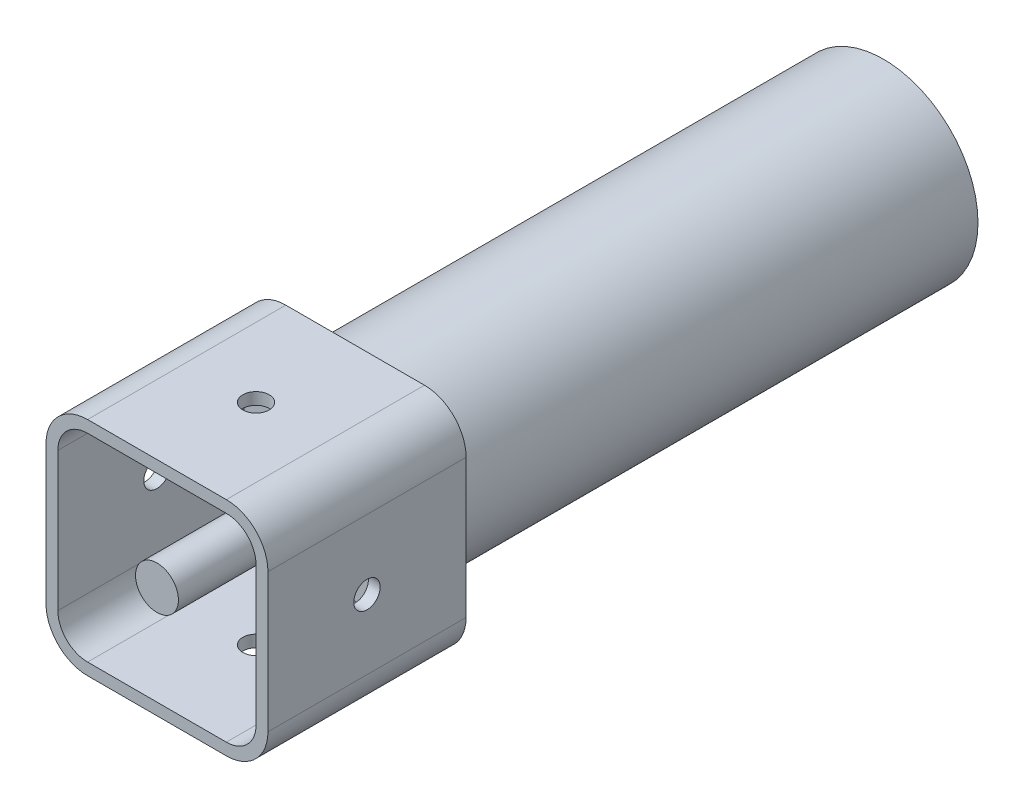
ISO-10303-21;
HEADER;
FILE_DESCRIPTION(('STEP AP214'),'2;1');
FILE_NAME('part.step','',(''),(''),'','','');
FILE_SCHEMA(('AUTOMOTIVE_DESIGN { 1 0 10303 214 1 1 1 1 }'));
ENDSEC;
DATA;
#1=APPLICATION_CONTEXT('core data for automotive mechanical design processes');
#2=APPLICATION_PROTOCOL_DEFINITION('international standard','automotive_design',2000,#1);
#3=PRODUCT_CONTEXT('',#1,'mechanical');
#4=PRODUCT('Part','Part','',(#3));
#5=PRODUCT_RELATED_PRODUCT_CATEGORY('part','',(#4));
#6=PRODUCT_DEFINITION_FORMATION('','',#4);
#7=PRODUCT_DEFINITION_CONTEXT('part definition',#1,'design');
#8=PRODUCT_DEFINITION('design','',#6,#7);
#9=PRODUCT_DEFINITION_SHAPE('','',#8);
#10=(LENGTH_UNIT() NAMED_UNIT(*) SI_UNIT(.MILLI.,.METRE.));
#11=(NAMED_UNIT(*) PLANE_ANGLE_UNIT() SI_UNIT($,.RADIAN.));
#12=(NAMED_UNIT(*) SI_UNIT($,.STERADIAN.) SOLID_ANGLE_UNIT());
#13=UNCERTAINTY_MEASURE_WITH_UNIT(LENGTH_MEASURE(1.E-05),#10,'distance_accuracy_value','');
#14=(GEOMETRIC_REPRESENTATION_CONTEXT(3) GLOBAL_UNCERTAINTY_ASSIGNED_CONTEXT((#13)) GLOBAL_UNIT_ASSIGNED_CONTEXT((#10,
#11,#12)) REPRESENTATION_CONTEXT('',''));
#15=CARTESIAN_POINT('',(0.,0.,0.));
#16=DIRECTION('',(0.,0.,1.));
#17=DIRECTION('',(1.,0.,0.));
#18=AXIS2_PLACEMENT_3D('',#15,#16,#17);
#19=CARTESIAN_POINT('',(0.,0.,0.));
#20=DIRECTION('',(0.,0.,1.));
#21=DIRECTION('',(1.,0.,0.));
#22=AXIS2_PLACEMENT_3D('',#19,#20,#21);
#23=PLANE('',#22);
#24=CARTESIAN_POINT('',(0.,0.,0.));
#25=DIRECTION('',(0.,0.,1.));
#26=DIRECTION('',(1.,0.,0.));
#27=AXIS2_PLACEMENT_3D('',#24,#25,#26);
#28=CIRCLE('',#27,16.3);
#29=CARTESIAN_POINT('',(16.3,0.,0.));
#30=VERTEX_POINT('',#29);
#31=EDGE_CURVE('E11',#30,#30,#28,.T.);
#32=ORIENTED_EDGE('',*,*,#31,.T.);
#33=EDGE_LOOP('',(#32));
#34=FACE_BOUND('',#33,.T.);
#35=DIRECTION('',(-1.,0.,0.));
#36=VECTOR('',#35,1.);
#37=CARTESIAN_POINT('',(0.,16.8,0.));
#38=LINE('',#37,#36);
#39=CARTESIAN_POINT('',(10.5,16.8,0.));
#40=VERTEX_POINT('',#39);
#41=CARTESIAN_POINT('',(-10.5,16.8,0.));
#42=VERTEX_POINT('',#41);
#43=EDGE_CURVE('E237',#40,#42,#38,.T.);
#44=ORIENTED_EDGE('',*,*,#43,.F.);
#45=CARTESIAN_POINT('',(10.5,10.5,0.));
#46=DIRECTION('',(0.,0.,1.));
#47=DIRECTION('',(1.,0.,0.));
#48=AXIS2_PLACEMENT_3D('',#45,#46,#47);
#49=CIRCLE('',#48,6.3);
#50=CARTESIAN_POINT('',(16.8,10.5,0.));
#51=VERTEX_POINT('',#50);
#52=EDGE_CURVE('E293',#40,#51,#49,.F.);
#53=ORIENTED_EDGE('',*,*,#52,.T.);
#54=DIRECTION('',(0.,-1.,0.));
#55=VECTOR('',#54,1.);
#56=CARTESIAN_POINT('',(16.8,0.,0.));
#57=LINE('',#56,#55);
#58=CARTESIAN_POINT('',(16.8,-10.5,0.));
#59=VERTEX_POINT('',#58);
#60=EDGE_CURVE('E326',#51,#59,#57,.T.);
#61=ORIENTED_EDGE('',*,*,#60,.T.);
#62=CARTESIAN_POINT('',(10.5,-10.5,0.));
#63=DIRECTION('',(0.,0.,1.));
#64=DIRECTION('',(1.,0.,0.));
#65=AXIS2_PLACEMENT_3D('',#62,#63,#64);
#66=CIRCLE('',#65,6.3);
#67=CARTESIAN_POINT('',(10.5,-16.8,0.));
#68=VERTEX_POINT('',#67);
#69=EDGE_CURVE('E323',#68,#59,#66,.T.);
#70=ORIENTED_EDGE('',*,*,#69,.F.);
#71=DIRECTION('',(-1.,0.,0.));
#72=VECTOR('',#71,1.);
#73=CARTESIAN_POINT('',(0.,-16.8,0.));
#74=LINE('',#73,#72);
#75=CARTESIAN_POINT('',(-10.5,-16.8,0.));
#76=VERTEX_POINT('',#75);
#77=EDGE_CURVE('E320',#68,#76,#74,.T.);
#78=ORIENTED_EDGE('',*,*,#77,.T.);
#79=CARTESIAN_POINT('',(-10.5,-10.5,0.));
#80=DIRECTION('',(0.,0.,1.));
#81=DIRECTION('',(1.,0.,0.));
#82=AXIS2_PLACEMENT_3D('',#79,#80,#81);
#83=CIRCLE('',#82,6.3);
#84=CARTESIAN_POINT('',(-16.8,-10.5,0.));
#85=VERTEX_POINT('',#84);
#86=EDGE_CURVE('E317',#85,#76,#83,.T.);
#87=ORIENTED_EDGE('',*,*,#86,.F.);
#88=DIRECTION('',(0.,-1.,0.));
#89=VECTOR('',#88,1.);
#90=CARTESIAN_POINT('',(-16.8,0.,0.));
#91=LINE('',#90,#89);
#92=CARTESIAN_POINT('',(-16.8,10.5,0.));
#93=VERTEX_POINT('',#92);
#94=EDGE_CURVE('E315',#93,#85,#91,.T.);
#95=ORIENTED_EDGE('',*,*,#94,.F.);
#96=CARTESIAN_POINT('',(-10.5,10.5,0.));
#97=DIRECTION('',(0.,0.,1.));
#98=DIRECTION('',(1.,0.,0.));
#99=AXIS2_PLACEMENT_3D('',#96,#97,#98);
#100=CIRCLE('',#99,6.3);
#101=EDGE_CURVE('E313',#42,#93,#100,.T.);
#102=ORIENTED_EDGE('',*,*,#101,.F.);
#103=EDGE_LOOP('',(#44,#53,#61,#70,#78,#87,#95,#102));
#104=FACE_BOUND('',#103,.T.);
#105=ADVANCED_FACE('F32',(#34,#104),#23,.F.);
#106=CARTESIAN_POINT('',(0.,0.,1.8));
#107=DIRECTION('',(0.,0.,1.));
#108=DIRECTION('',(1.,0.,0.));
#109=AXIS2_PLACEMENT_3D('',#106,#107,#108);
#110=PLANE('',#109);
#111=DIRECTION('',(-1.,0.,0.));
#112=VECTOR('',#111,1.);
#113=CARTESIAN_POINT('',(0.,15.,1.8));
#114=LINE('',#113,#112);
#115=CARTESIAN_POINT('',(10.5,15.,1.8));
#116=VERTEX_POINT('',#115);
#117=CARTESIAN_POINT('',(-10.5,15.,1.8));
#118=VERTEX_POINT('',#117);
#119=EDGE_CURVE('E230',#116,#118,#114,.T.);
#120=ORIENTED_EDGE('',*,*,#119,.T.);
#121=CARTESIAN_POINT('',(-10.5,10.5,1.8));
#122=DIRECTION('',(0.,0.,1.));
#123=DIRECTION('',(1.,0.,0.));
#124=AXIS2_PLACEMENT_3D('',#121,#122,#123);
#125=CIRCLE('',#124,4.5);
#126=CARTESIAN_POINT('',(-15.,10.5,1.8));
#127=VERTEX_POINT('',#126);
#128=EDGE_CURVE('E233',#118,#127,#125,.T.);
#129=ORIENTED_EDGE('',*,*,#128,.T.);
#130=DIRECTION('',(0.,-1.,0.));
#131=VECTOR('',#130,1.);
#132=CARTESIAN_POINT('',(-15.,0.,1.8));
#133=LINE('',#132,#131);
#134=CARTESIAN_POINT('',(-15.,-10.5,1.8));
#135=VERTEX_POINT('',#134);
#136=EDGE_CURVE('E244',#127,#135,#133,.T.);
#137=ORIENTED_EDGE('',*,*,#136,.T.);
#138=CARTESIAN_POINT('',(-10.5,-10.5,1.8));
#139=DIRECTION('',(0.,0.,1.));
#140=DIRECTION('',(1.,0.,0.));
#141=AXIS2_PLACEMENT_3D('',#138,#139,#140);
#142=CIRCLE('',#141,4.5);
#143=CARTESIAN_POINT('',(-10.5,-15.,1.8));
#144=VERTEX_POINT('',#143);
#145=EDGE_CURVE('E249',#135,#144,#142,.T.);
#146=ORIENTED_EDGE('',*,*,#145,.T.);
#147=DIRECTION('',(-1.,0.,0.));
#148=VECTOR('',#147,1.);
#149=CARTESIAN_POINT('',(0.,-15.,1.8));
#150=LINE('',#149,#148);
#151=CARTESIAN_POINT('',(10.5,-15.,1.8));
#152=VERTEX_POINT('',#151);
#153=EDGE_CURVE('E255',#152,#144,#150,.T.);
#154=ORIENTED_EDGE('',*,*,#153,.F.);
#155=CARTESIAN_POINT('',(10.5,-10.5,1.8));
#156=DIRECTION('',(0.,0.,1.));
#157=DIRECTION('',(1.,0.,0.));
#158=AXIS2_PLACEMENT_3D('',#155,#156,#157);
#159=CIRCLE('',#158,4.5);
#160=CARTESIAN_POINT('',(15.,-10.5,1.8));
#161=VERTEX_POINT('',#160);
#162=EDGE_CURVE('E260',#152,#161,#159,.T.);
#163=ORIENTED_EDGE('',*,*,#162,.T.);
#164=DIRECTION('',(0.,-1.,0.));
#165=VECTOR('',#164,1.);
#166=CARTESIAN_POINT('',(15.,0.,1.8));
#167=LINE('',#166,#165);
#168=CARTESIAN_POINT('',(15.,10.5,1.8));
#169=VERTEX_POINT('',#168);
#170=EDGE_CURVE('E265',#169,#161,#167,.T.);
#171=ORIENTED_EDGE('',*,*,#170,.F.);
#172=CARTESIAN_POINT('',(10.5,10.5,1.8));
#173=DIRECTION('',(0.,0.,1.));
#174=DIRECTION('',(1.,0.,0.));
#175=AXIS2_PLACEMENT_3D('',#172,#173,#174);
#176=CIRCLE('',#175,4.5);
#177=EDGE_CURVE('E269',#116,#169,#176,.F.);
#178=ORIENTED_EDGE('',*,*,#177,.F.);
#179=EDGE_LOOP('',(#120,#129,#137,#146,#154,#163,#171,#178));
#180=FACE_BOUND('',#179,.T.);
#181=CARTESIAN_POINT('',(0.,0.,1.8));
#182=DIRECTION('',(0.,0.,1.));
#183=DIRECTION('',(1.,0.,0.));
#184=AXIS2_PLACEMENT_3D('',#181,#182,#183);
#185=CIRCLE('',#184,3.25);
#186=CARTESIAN_POINT('',(3.25,0.,1.8));
#187=VERTEX_POINT('',#186);
#188=EDGE_CURVE('E229',#187,#187,#185,.F.);
#189=ORIENTED_EDGE('',*,*,#188,.T.);
#190=EDGE_LOOP('',(#189));
#191=FACE_BOUND('',#190,.T.);
#192=ADVANCED_FACE('F365',(#180,#191),#110,.T.);
#193=CARTESIAN_POINT('',(0.,16.8,30.));
#194=DIRECTION('',(0.,-1.,0.));
#195=DIRECTION('',(0.,0.,-1.));
#196=AXIS2_PLACEMENT_3D('',#193,#194,#195);
#197=PLANE('',#196);
#198=CARTESIAN_POINT('',(0.,16.8,15.));
#199=DIRECTION('',(0.,1.,0.));
#200=DIRECTION('',(0.,0.,1.));
#201=AXIS2_PLACEMENT_3D('',#198,#199,#200);
#202=CIRCLE('',#201,2.);
#203=CARTESIAN_POINT('',(0.,16.8,17.));
#204=VERTEX_POINT('',#203);
#205=EDGE_CURVE('E223',#204,#204,#202,.T.);
#206=ORIENTED_EDGE('',*,*,#205,.F.);
#207=EDGE_LOOP('',(#206));
#208=FACE_BOUND('',#207,.T.);
#209=ORIENTED_EDGE('',*,*,#43,.T.);
#210=DIRECTION('',(0.,0.,-1.));
#211=VECTOR('',#210,1.);
#212=CARTESIAN_POINT('',(-10.5,16.8,30.));
#213=LINE('',#212,#211);
#214=CARTESIAN_POINT('',(-10.5,16.8,30.));
#215=VERTEX_POINT('',#214);
#216=EDGE_CURVE('E346',#215,#42,#213,.T.);
#217=ORIENTED_EDGE('',*,*,#216,.F.);
#218=DIRECTION('',(-1.,0.,0.));
#219=VECTOR('',#218,1.);
#220=CARTESIAN_POINT('',(0.,16.8,30.));
#221=LINE('',#220,#219);
#222=CARTESIAN_POINT('',(10.5,16.8,30.));
#223=VERTEX_POINT('',#222);
#224=EDGE_CURVE('E289',#223,#215,#221,.T.);
#225=ORIENTED_EDGE('',*,*,#224,.F.);
#226=DIRECTION('',(0.,0.,-1.));
#227=VECTOR('',#226,1.);
#228=CARTESIAN_POINT('',(10.5,16.8,30.));
#229=LINE('',#228,#227);
#230=EDGE_CURVE('E310',#223,#40,#229,.T.);
#231=ORIENTED_EDGE('',*,*,#230,.T.);
#232=EDGE_LOOP('',(#209,#217,#225,#231));
#233=FACE_BOUND('',#232,.T.);
#234=ADVANCED_FACE('F372',(#208,#233),#197,.F.);
#235=CARTESIAN_POINT('',(-10.5,10.5,30.));
#236=DIRECTION('',(0.,0.,-1.));
#237=DIRECTION('',(-1.,0.,0.));
#238=AXIS2_PLACEMENT_3D('',#235,#236,#237);
#239=CYLINDRICAL_SURFACE('',#238,6.3);
#240=ORIENTED_EDGE('',*,*,#101,.T.);
#241=DIRECTION('',(0.,0.,-1.));
#242=VECTOR('',#241,1.);
#243=CARTESIAN_POINT('',(-16.8,10.5,30.));
#244=LINE('',#243,#242);
#245=CARTESIAN_POINT('',(-16.8,10.5,30.));
#246=VERTEX_POINT('',#245);
#247=EDGE_CURVE('E343',#246,#93,#244,.T.);
#248=ORIENTED_EDGE('',*,*,#247,.F.);
#249=CARTESIAN_POINT('',(-10.5,10.5,30.));
#250=DIRECTION('',(0.,0.,1.));
#251=DIRECTION('',(1.,0.,0.));
#252=AXIS2_PLACEMENT_3D('',#249,#250,#251);
#253=CIRCLE('',#252,6.3);
#254=EDGE_CURVE('E292',#215,#246,#253,.T.);
#255=ORIENTED_EDGE('',*,*,#254,.F.);
#256=ORIENTED_EDGE('',*,*,#216,.T.);
#257=EDGE_LOOP('',(#240,#248,#255,#256));
#258=FACE_BOUND('',#257,.T.);
#259=ADVANCED_FACE('F471',(#258),#239,.T.);
#260=CARTESIAN_POINT('',(-16.8,0.,30.));
#261=DIRECTION('',(1.,0.,0.));
#262=DIRECTION('',(0.,1.,0.));
#263=AXIS2_PLACEMENT_3D('',#260,#261,#262);
#264=PLANE('',#263);
#265=CARTESIAN_POINT('',(-16.8,1.77813803170919E-13,15.));
#266=DIRECTION('',(-1.,0.,0.));
#267=DIRECTION('',(0.,0.,1.));
#268=AXIS2_PLACEMENT_3D('',#265,#266,#267);
#269=CIRCLE('',#268,2.);
#270=CARTESIAN_POINT('',(-16.8,1.77813803170919E-13,17.));
#271=VERTEX_POINT('',#270);
#272=EDGE_CURVE('E205',#271,#271,#269,.T.);
#273=ORIENTED_EDGE('',*,*,#272,.F.);
#274=EDGE_LOOP('',(#273));
#275=FACE_BOUND('',#274,.T.);
#276=ORIENTED_EDGE('',*,*,#94,.T.);
#277=DIRECTION('',(0.,0.,-1.));
#278=VECTOR('',#277,1.);
#279=CARTESIAN_POINT('',(-16.8,-10.5,30.));
#280=LINE('',#279,#278);
#281=CARTESIAN_POINT('',(-16.8,-10.5,30.));
#282=VERTEX_POINT('',#281);
#283=EDGE_CURVE('E340',#282,#85,#280,.T.);
#284=ORIENTED_EDGE('',*,*,#283,.F.);
#285=DIRECTION('',(0.,-1.,0.));
#286=VECTOR('',#285,1.);
#287=CARTESIAN_POINT('',(-16.8,0.,30.));
#288=LINE('',#287,#286);
#289=EDGE_CURVE('E295',#246,#282,#288,.T.);
#290=ORIENTED_EDGE('',*,*,#289,.F.);
#291=ORIENTED_EDGE('',*,*,#247,.T.);
#292=EDGE_LOOP('',(#276,#284,#290,#291));
#293=FACE_BOUND('',#292,.T.);
#294=ADVANCED_FACE('F476',(#275,#293),#264,.F.);
#295=CARTESIAN_POINT('',(-10.5,-10.5,30.));
#296=DIRECTION('',(0.,0.,-1.));
#297=DIRECTION('',(-1.,0.,0.));
#298=AXIS2_PLACEMENT_3D('',#295,#296,#297);
#299=CYLINDRICAL_SURFACE('',#298,6.3);
#300=ORIENTED_EDGE('',*,*,#86,.T.);
#301=DIRECTION('',(0.,0.,-1.));
#302=VECTOR('',#301,1.);
#303=CARTESIAN_POINT('',(-10.5,-16.8,30.));
#304=LINE('',#303,#302);
#305=CARTESIAN_POINT('',(-10.5,-16.8,30.));
#306=VERTEX_POINT('',#305);
#307=EDGE_CURVE('E338',#306,#76,#304,.T.);
#308=ORIENTED_EDGE('',*,*,#307,.F.);
#309=CARTESIAN_POINT('',(-10.5,-10.5,30.));
#310=DIRECTION('',(0.,0.,1.));
#311=DIRECTION('',(1.,0.,0.));
#312=AXIS2_PLACEMENT_3D('',#309,#310,#311);
#313=CIRCLE('',#312,6.3);
#314=EDGE_CURVE('E297',#282,#306,#313,.T.);
#315=ORIENTED_EDGE('',*,*,#314,.F.);
#316=ORIENTED_EDGE('',*,*,#283,.T.);
#317=EDGE_LOOP('',(#300,#308,#315,#316));
#318=FACE_BOUND('',#317,.T.);
#319=ADVANCED_FACE('F481',(#318),#299,.T.);
#320=CARTESIAN_POINT('',(0.,-16.8,30.));
#321=DIRECTION('',(0.,-1.,0.));
#322=DIRECTION('',(0.,0.,-1.));
#323=AXIS2_PLACEMENT_3D('',#320,#321,#322);
#324=PLANE('',#323);
#325=CARTESIAN_POINT('',(0.,-16.8,15.));
#326=DIRECTION('',(0.,-1.,0.));
#327=DIRECTION('',(0.,0.,1.));
#328=AXIS2_PLACEMENT_3D('',#325,#326,#327);
#329=CIRCLE('',#328,2.);
#330=CARTESIAN_POINT('',(0.,-16.8,17.));
#331=VERTEX_POINT('',#330);
#332=EDGE_CURVE('E211',#331,#331,#329,.T.);
#333=ORIENTED_EDGE('',*,*,#332,.F.);
#334=EDGE_LOOP('',(#333));
#335=FACE_BOUND('',#334,.T.);
#336=ORIENTED_EDGE('',*,*,#77,.F.);
#337=DIRECTION('',(0.,0.,-1.));
#338=VECTOR('',#337,1.);
#339=CARTESIAN_POINT('',(10.5,-16.8,30.));
#340=LINE('',#339,#338);
#341=CARTESIAN_POINT('',(10.5,-16.8,30.));
#342=VERTEX_POINT('',#341);
#343=EDGE_CURVE('E336',#342,#68,#340,.T.);
#344=ORIENTED_EDGE('',*,*,#343,.F.);
#345=DIRECTION('',(-1.,0.,0.));
#346=VECTOR('',#345,1.);
#347=CARTESIAN_POINT('',(0.,-16.8,30.));
#348=LINE('',#347,#346);
#349=EDGE_CURVE('E299',#342,#306,#348,.T.);
#350=ORIENTED_EDGE('',*,*,#349,.T.);
#351=ORIENTED_EDGE('',*,*,#307,.T.);
#352=EDGE_LOOP('',(#336,#344,#350,#351));
#353=FACE_BOUND('',#352,.T.);
#354=ADVANCED_FACE('F485',(#335,#353),#324,.T.);
#355=CARTESIAN_POINT('',(10.5,-10.5,30.));
#356=DIRECTION('',(0.,0.,-1.));
#357=DIRECTION('',(-1.,0.,0.));
#358=AXIS2_PLACEMENT_3D('',#355,#356,#357);
#359=CYLINDRICAL_SURFACE('',#358,6.3);
#360=ORIENTED_EDGE('',*,*,#69,.T.);
#361=DIRECTION('',(0.,0.,-1.));
#362=VECTOR('',#361,1.);
#363=CARTESIAN_POINT('',(16.8,-10.5,30.));
#364=LINE('',#363,#362);
#365=CARTESIAN_POINT('',(16.8,-10.5,30.));
#366=VERTEX_POINT('',#365);
#367=EDGE_CURVE('E334',#366,#59,#364,.T.);
#368=ORIENTED_EDGE('',*,*,#367,.F.);
#369=CARTESIAN_POINT('',(10.5,-10.5,30.));
#370=DIRECTION('',(0.,0.,1.));
#371=DIRECTION('',(1.,0.,0.));
#372=AXIS2_PLACEMENT_3D('',#369,#370,#371);
#373=CIRCLE('',#372,6.3);
#374=EDGE_CURVE('E302',#342,#366,#373,.T.);
#375=ORIENTED_EDGE('',*,*,#374,.F.);
#376=ORIENTED_EDGE('',*,*,#343,.T.);
#377=EDGE_LOOP('',(#360,#368,#375,#376));
#378=FACE_BOUND('',#377,.T.);
#379=ADVANCED_FACE('F490',(#378),#359,.T.);
#380=CARTESIAN_POINT('',(16.8,0.,30.));
#381=DIRECTION('',(1.,0.,0.));
#382=DIRECTION('',(0.,0.,-1.));
#383=AXIS2_PLACEMENT_3D('',#380,#381,#382);
#384=PLANE('',#383);
#385=CARTESIAN_POINT('',(16.8,0.,15.));
#386=DIRECTION('',(1.,0.,0.));
#387=DIRECTION('',(0.,0.,1.));
#388=AXIS2_PLACEMENT_3D('',#385,#386,#387);
#389=CIRCLE('',#388,2.);
#390=CARTESIAN_POINT('',(16.8,0.,17.));
#391=VERTEX_POINT('',#390);
#392=EDGE_CURVE('E214',#391,#391,#389,.T.);
#393=ORIENTED_EDGE('',*,*,#392,.F.);
#394=EDGE_LOOP('',(#393));
#395=FACE_BOUND('',#394,.T.);
#396=ORIENTED_EDGE('',*,*,#60,.F.);
#397=DIRECTION('',(0.,0.,-1.));
#398=VECTOR('',#397,1.);
#399=CARTESIAN_POINT('',(16.8,10.5,30.));
#400=LINE('',#399,#398);
#401=CARTESIAN_POINT('',(16.8,10.5,30.));
#402=VERTEX_POINT('',#401);
#403=EDGE_CURVE('E332',#402,#51,#400,.T.);
#404=ORIENTED_EDGE('',*,*,#403,.F.);
#405=DIRECTION('',(0.,-1.,0.));
#406=VECTOR('',#405,1.);
#407=CARTESIAN_POINT('',(16.8,0.,30.));
#408=LINE('',#407,#406);
#409=EDGE_CURVE('E304',#402,#366,#408,.T.);
#410=ORIENTED_EDGE('',*,*,#409,.T.);
#411=ORIENTED_EDGE('',*,*,#367,.T.);
#412=EDGE_LOOP('',(#396,#404,#410,#411));
#413=FACE_BOUND('',#412,.T.);
#414=ADVANCED_FACE('F458',(#395,#413),#384,.T.);
#415=CARTESIAN_POINT('',(10.5,10.5,30.));
#416=DIRECTION('',(0.,0.,-1.));
#417=DIRECTION('',(-1.,0.,0.));
#418=AXIS2_PLACEMENT_3D('',#415,#416,#417);
#419=CYLINDRICAL_SURFACE('',#418,6.3);
#420=ORIENTED_EDGE('',*,*,#52,.F.);
#421=ORIENTED_EDGE('',*,*,#230,.F.);
#422=CARTESIAN_POINT('',(10.5,10.5,30.));
#423=DIRECTION('',(0.,0.,1.));
#424=DIRECTION('',(1.,0.,0.));
#425=AXIS2_PLACEMENT_3D('',#422,#423,#424);
#426=CIRCLE('',#425,6.3);
#427=EDGE_CURVE('E307',#223,#402,#426,.F.);
#428=ORIENTED_EDGE('',*,*,#427,.T.);
#429=ORIENTED_EDGE('',*,*,#403,.T.);
#430=EDGE_LOOP('',(#420,#421,#428,#429));
#431=FACE_BOUND('',#430,.T.);
#432=ADVANCED_FACE('F453',(#431),#419,.T.);
#433=CARTESIAN_POINT('',(0.,0.,30.));
#434=DIRECTION('',(0.,0.,1.));
#435=DIRECTION('',(1.,0.,0.));
#436=AXIS2_PLACEMENT_3D('',#433,#434,#435);
#437=PLANE('',#436);
#438=DIRECTION('',(-1.,0.,0.));
#439=VECTOR('',#438,1.);
#440=CARTESIAN_POINT('',(0.,15.,30.));
#441=LINE('',#440,#439);
#442=CARTESIAN_POINT('',(10.5,15.,30.));
#443=VERTEX_POINT('',#442);
#444=CARTESIAN_POINT('',(-10.5,15.,30.));
#445=VERTEX_POINT('',#444);
#446=EDGE_CURVE('E273',#443,#445,#441,.T.);
#447=ORIENTED_EDGE('',*,*,#446,.F.);
#448=CARTESIAN_POINT('',(10.5,10.5,30.));
#449=DIRECTION('',(0.,0.,1.));
#450=DIRECTION('',(1.,0.,0.));
#451=AXIS2_PLACEMENT_3D('',#448,#449,#450);
#452=CIRCLE('',#451,4.5);
#453=CARTESIAN_POINT('',(15.,10.5,30.));
#454=VERTEX_POINT('',#453);
#455=EDGE_CURVE('E242',#443,#454,#452,.F.);
#456=ORIENTED_EDGE('',*,*,#455,.T.);
#457=DIRECTION('',(0.,-1.,0.));
#458=VECTOR('',#457,1.);
#459=CARTESIAN_POINT('',(15.,0.,30.));
#460=LINE('',#459,#458);
#461=CARTESIAN_POINT('',(15.,-10.5,30.));
#462=VERTEX_POINT('',#461);
#463=EDGE_CURVE('E55',#454,#462,#460,.T.);
#464=ORIENTED_EDGE('',*,*,#463,.T.);
#465=CARTESIAN_POINT('',(10.5,-10.5,30.));
#466=DIRECTION('',(0.,0.,1.));
#467=DIRECTION('',(1.,0.,0.));
#468=AXIS2_PLACEMENT_3D('',#465,#466,#467);
#469=CIRCLE('',#468,4.5);
#470=CARTESIAN_POINT('',(10.5,-15.,30.));
#471=VERTEX_POINT('',#470);
#472=EDGE_CURVE('E284',#471,#462,#469,.T.);
#473=ORIENTED_EDGE('',*,*,#472,.F.);
#474=DIRECTION('',(-1.,0.,0.));
#475=VECTOR('',#474,1.);
#476=CARTESIAN_POINT('',(0.,-15.,30.));
#477=LINE('',#476,#475);
#478=CARTESIAN_POINT('',(-10.5,-15.,30.));
#479=VERTEX_POINT('',#478);
#480=EDGE_CURVE('E281',#471,#479,#477,.T.);
#481=ORIENTED_EDGE('',*,*,#480,.T.);
#482=CARTESIAN_POINT('',(-10.5,-10.5,30.));
#483=DIRECTION('',(0.,0.,1.));
#484=DIRECTION('',(1.,0.,0.));
#485=AXIS2_PLACEMENT_3D('',#482,#483,#484);
#486=CIRCLE('',#485,4.5);
#487=CARTESIAN_POINT('',(-15.,-10.5,30.));
#488=VERTEX_POINT('',#487);
#489=EDGE_CURVE('E279',#488,#479,#486,.T.);
#490=ORIENTED_EDGE('',*,*,#489,.F.);
#491=DIRECTION('',(0.,-1.,0.));
#492=VECTOR('',#491,1.);
#493=CARTESIAN_POINT('',(-15.,0.,30.));
#494=LINE('',#493,#492);
#495=CARTESIAN_POINT('',(-15.,10.5,30.));
#496=VERTEX_POINT('',#495);
#497=EDGE_CURVE('E277',#496,#488,#494,.T.);
#498=ORIENTED_EDGE('',*,*,#497,.F.);
#499=CARTESIAN_POINT('',(-10.5,10.5,30.));
#500=DIRECTION('',(0.,0.,1.));
#501=DIRECTION('',(1.,0.,0.));
#502=AXIS2_PLACEMENT_3D('',#499,#500,#501);
#503=CIRCLE('',#502,4.5);
#504=EDGE_CURVE('E275',#445,#496,#503,.T.);
#505=ORIENTED_EDGE('',*,*,#504,.F.);
#506=EDGE_LOOP('',(#447,#456,#464,#473,#481,#490,#498,#505));
#507=FACE_BOUND('',#506,.T.);
#508=ORIENTED_EDGE('',*,*,#224,.T.);
#509=ORIENTED_EDGE('',*,*,#254,.T.);
#510=ORIENTED_EDGE('',*,*,#289,.T.);
#511=ORIENTED_EDGE('',*,*,#314,.T.);
#512=ORIENTED_EDGE('',*,*,#349,.F.);
#513=ORIENTED_EDGE('',*,*,#374,.T.);
#514=ORIENTED_EDGE('',*,*,#409,.F.);
#515=ORIENTED_EDGE('',*,*,#427,.F.);
#516=EDGE_LOOP('',(#508,#509,#510,#511,#512,#513,#514,#515));
#517=FACE_BOUND('',#516,.T.);
#518=ADVANCED_FACE('F425',(#507,#517),#437,.T.);
#519=CARTESIAN_POINT('',(0.,15.,30.));
#520=DIRECTION('',(0.,-1.,0.));
#521=DIRECTION('',(0.,0.,-1.));
#522=AXIS2_PLACEMENT_3D('',#519,#520,#521);
#523=PLANE('',#522);
#524=CARTESIAN_POINT('',(0.,15.,15.));
#525=DIRECTION('',(0.,-1.,0.));
#526=DIRECTION('',(0.,0.,-1.));
#527=AXIS2_PLACEMENT_3D('',#524,#525,#526);
#528=CIRCLE('',#527,2.);
#529=CARTESIAN_POINT('',(0.,15.,13.));
#530=VERTEX_POINT('',#529);
#531=EDGE_CURVE('E220',#530,#530,#528,.F.);
#532=ORIENTED_EDGE('',*,*,#531,.T.);
#533=EDGE_LOOP('',(#532));
#534=FACE_BOUND('',#533,.T.);
#535=ORIENTED_EDGE('',*,*,#119,.F.);
#536=DIRECTION('',(0.,0.,-1.));
#537=VECTOR('',#536,1.);
#538=CARTESIAN_POINT('',(10.5,15.,30.));
#539=LINE('',#538,#537);
#540=EDGE_CURVE('E239',#443,#116,#539,.T.);
#541=ORIENTED_EDGE('',*,*,#540,.F.);
#542=ORIENTED_EDGE('',*,*,#446,.T.);
#543=DIRECTION('',(0.,0.,-1.));
#544=VECTOR('',#543,1.);
#545=CARTESIAN_POINT('',(-10.5,15.,30.));
#546=LINE('',#545,#544);
#547=EDGE_CURVE('E234',#445,#118,#546,.T.);
#548=ORIENTED_EDGE('',*,*,#547,.T.);
#549=EDGE_LOOP('',(#535,#541,#542,#548));
#550=FACE_BOUND('',#549,.T.);
#551=ADVANCED_FACE('F421',(#534,#550),#523,.T.);
#552=CARTESIAN_POINT('',(-10.5,10.5,30.));
#553=DIRECTION('',(0.,0.,-1.));
#554=DIRECTION('',(-1.,0.,0.));
#555=AXIS2_PLACEMENT_3D('',#552,#553,#554);
#556=CYLINDRICAL_SURFACE('',#555,4.5);
#557=ORIENTED_EDGE('',*,*,#128,.F.);
#558=ORIENTED_EDGE('',*,*,#547,.F.);
#559=ORIENTED_EDGE('',*,*,#504,.T.);
#560=DIRECTION('',(0.,0.,1.));
#561=VECTOR('',#560,1.);
#562=CARTESIAN_POINT('',(-15.,10.5,30.));
#563=LINE('',#562,#561);
#564=EDGE_CURVE('E238',#496,#127,#563,.F.);
#565=ORIENTED_EDGE('',*,*,#564,.T.);
#566=EDGE_LOOP('',(#557,#558,#559,#565));
#567=FACE_BOUND('',#566,.T.);
#568=ADVANCED_FACE('F424',(#567),#556,.F.);
#569=CARTESIAN_POINT('',(-15.,0.,30.));
#570=DIRECTION('',(1.,0.,0.));
#571=DIRECTION('',(0.,1.,0.));
#572=AXIS2_PLACEMENT_3D('',#569,#570,#571);
#573=PLANE('',#572);
#574=CARTESIAN_POINT('',(-15.,1.58959803941166E-13,15.));
#575=DIRECTION('',(1.,0.,0.));
#576=DIRECTION('',(0.,1.,0.));
#577=AXIS2_PLACEMENT_3D('',#574,#575,#576);
#578=CIRCLE('',#577,2.);
#579=CARTESIAN_POINT('',(-15.,2.00000000000016,15.));
#580=VERTEX_POINT('',#579);
#581=EDGE_CURVE('E197',#580,#580,#578,.F.);
#582=ORIENTED_EDGE('',*,*,#581,.T.);
#583=EDGE_LOOP('',(#582));
#584=FACE_BOUND('',#583,.T.);
#585=ORIENTED_EDGE('',*,*,#136,.F.);
#586=ORIENTED_EDGE('',*,*,#564,.F.);
#587=ORIENTED_EDGE('',*,*,#497,.T.);
#588=DIRECTION('',(0.,0.,-1.));
#589=VECTOR('',#588,1.);
#590=CARTESIAN_POINT('',(-15.,-10.5,30.));
#591=LINE('',#590,#589);
#592=EDGE_CURVE('E247',#488,#135,#591,.T.);
#593=ORIENTED_EDGE('',*,*,#592,.T.);
#594=EDGE_LOOP('',(#585,#586,#587,#593));
#595=FACE_BOUND('',#594,.T.);
#596=ADVANCED_FACE('F429',(#584,#595),#573,.T.);
#597=CARTESIAN_POINT('',(-10.5,-10.5,30.));
#598=DIRECTION('',(0.,0.,-1.));
#599=DIRECTION('',(-1.,0.,0.));
#600=AXIS2_PLACEMENT_3D('',#597,#598,#599);
#601=CYLINDRICAL_SURFACE('',#600,4.5);
#602=ORIENTED_EDGE('',*,*,#145,.F.);
#603=ORIENTED_EDGE('',*,*,#592,.F.);
#604=ORIENTED_EDGE('',*,*,#489,.T.);
#605=DIRECTION('',(0.,0.,-1.));
#606=VECTOR('',#605,1.);
#607=CARTESIAN_POINT('',(-10.5,-15.,30.));
#608=LINE('',#607,#606);
#609=EDGE_CURVE('E252',#479,#144,#608,.T.);
#610=ORIENTED_EDGE('',*,*,#609,.T.);
#611=EDGE_LOOP('',(#602,#603,#604,#610));
#612=FACE_BOUND('',#611,.T.);
#613=ADVANCED_FACE('F433',(#612),#601,.F.);
#614=CARTESIAN_POINT('',(0.,-15.,30.));
#615=DIRECTION('',(0.,-1.,0.));
#616=DIRECTION('',(0.,0.,-1.));
#617=AXIS2_PLACEMENT_3D('',#614,#615,#616);
#618=PLANE('',#617);
#619=CARTESIAN_POINT('',(0.,-15.,15.));
#620=DIRECTION('',(0.,-1.,0.));
#621=DIRECTION('',(0.,0.,-1.));
#622=AXIS2_PLACEMENT_3D('',#619,#620,#621);
#623=CIRCLE('',#622,2.);
#624=CARTESIAN_POINT('',(0.,-15.,13.));
#625=VERTEX_POINT('',#624);
#626=EDGE_CURVE('E208',#625,#625,#623,.F.);
#627=ORIENTED_EDGE('',*,*,#626,.F.);
#628=EDGE_LOOP('',(#627));
#629=FACE_BOUND('',#628,.T.);
#630=ORIENTED_EDGE('',*,*,#153,.T.);
#631=ORIENTED_EDGE('',*,*,#609,.F.);
#632=ORIENTED_EDGE('',*,*,#480,.F.);
#633=DIRECTION('',(0.,0.,-1.));
#634=VECTOR('',#633,1.);
#635=CARTESIAN_POINT('',(10.5,-15.,30.));
#636=LINE('',#635,#634);
#637=EDGE_CURVE('E257',#471,#152,#636,.T.);
#638=ORIENTED_EDGE('',*,*,#637,.T.);
#639=EDGE_LOOP('',(#630,#631,#632,#638));
#640=FACE_BOUND('',#639,.T.);
#641=ADVANCED_FACE('F437',(#629,#640),#618,.F.);
#642=CARTESIAN_POINT('',(10.5,-10.5,30.));
#643=DIRECTION('',(0.,0.,-1.));
#644=DIRECTION('',(-1.,0.,0.));
#645=AXIS2_PLACEMENT_3D('',#642,#643,#644);
#646=CYLINDRICAL_SURFACE('',#645,4.5);
#647=ORIENTED_EDGE('',*,*,#162,.F.);
#648=ORIENTED_EDGE('',*,*,#637,.F.);
#649=ORIENTED_EDGE('',*,*,#472,.T.);
#650=DIRECTION('',(0.,0.,-1.));
#651=VECTOR('',#650,1.);
#652=CARTESIAN_POINT('',(15.,-10.5,30.));
#653=LINE('',#652,#651);
#654=EDGE_CURVE('E262',#462,#161,#653,.T.);
#655=ORIENTED_EDGE('',*,*,#654,.T.);
#656=EDGE_LOOP('',(#647,#648,#649,#655));
#657=FACE_BOUND('',#656,.T.);
#658=ADVANCED_FACE('F441',(#657),#646,.F.);
#659=CARTESIAN_POINT('',(15.,0.,30.));
#660=DIRECTION('',(1.,0.,0.));
#661=DIRECTION('',(0.,0.,-1.));
#662=AXIS2_PLACEMENT_3D('',#659,#660,#661);
#663=PLANE('',#662);
#664=CARTESIAN_POINT('',(15.,0.,15.));
#665=DIRECTION('',(1.,0.,0.));
#666=DIRECTION('',(0.,0.,-1.));
#667=AXIS2_PLACEMENT_3D('',#664,#665,#666);
#668=CIRCLE('',#667,2.);
#669=CARTESIAN_POINT('',(15.,0.,13.));
#670=VERTEX_POINT('',#669);
#671=EDGE_CURVE('E217',#670,#670,#668,.F.);
#672=ORIENTED_EDGE('',*,*,#671,.F.);
#673=EDGE_LOOP('',(#672));
#674=FACE_BOUND('',#673,.T.);
#675=ORIENTED_EDGE('',*,*,#170,.T.);
#676=ORIENTED_EDGE('',*,*,#654,.F.);
#677=ORIENTED_EDGE('',*,*,#463,.F.);
#678=DIRECTION('',(0.,0.,-1.));
#679=VECTOR('',#678,1.);
#680=CARTESIAN_POINT('',(15.,10.5,30.));
#681=LINE('',#680,#679);
#682=EDGE_CURVE('E241',#454,#169,#681,.T.);
#683=ORIENTED_EDGE('',*,*,#682,.T.);
#684=EDGE_LOOP('',(#675,#676,#677,#683));
#685=FACE_BOUND('',#684,.T.);
#686=ADVANCED_FACE('F445',(#674,#685),#663,.F.);
#687=CARTESIAN_POINT('',(10.5,10.5,30.));
#688=DIRECTION('',(0.,0.,-1.));
#689=DIRECTION('',(-1.,0.,0.));
#690=AXIS2_PLACEMENT_3D('',#687,#688,#689);
#691=CYLINDRICAL_SURFACE('',#690,4.5);
#692=ORIENTED_EDGE('',*,*,#177,.T.);
#693=ORIENTED_EDGE('',*,*,#682,.F.);
#694=ORIENTED_EDGE('',*,*,#455,.F.);
#695=ORIENTED_EDGE('',*,*,#540,.T.);
#696=EDGE_LOOP('',(#692,#693,#694,#695));
#697=FACE_BOUND('',#696,.T.);
#698=ADVANCED_FACE('F419',(#697),#691,.F.);
#699=CARTESIAN_POINT('',(0.,0.,30.));
#700=DIRECTION('',(0.,0.,-1.));
#701=DIRECTION('',(-1.,0.,0.));
#702=AXIS2_PLACEMENT_3D('',#699,#700,#701);
#703=CYLINDRICAL_SURFACE('',#702,3.25);
#704=ORIENTED_EDGE('',*,*,#188,.F.);
#705=EDGE_LOOP('',(#704));
#706=FACE_BOUND('',#705,.T.);
#707=CARTESIAN_POINT('',(0.,0.,30.));
#708=DIRECTION('',(0.,0.,1.));
#709=DIRECTION('',(1.,0.,0.));
#710=AXIS2_PLACEMENT_3D('',#707,#708,#709);
#711=CIRCLE('',#710,3.25);
#712=CARTESIAN_POINT('',(3.25,0.,30.));
#713=VERTEX_POINT('',#712);
#714=EDGE_CURVE('E226',#713,#713,#711,.T.);
#715=ORIENTED_EDGE('',*,*,#714,.F.);
#716=EDGE_LOOP('',(#715));
#717=FACE_BOUND('',#716,.T.);
#718=ADVANCED_FACE('F415',(#706,#717),#703,.T.);
#719=CARTESIAN_POINT('',(0.,0.,30.));
#720=DIRECTION('',(0.,0.,1.));
#721=DIRECTION('',(1.,0.,0.));
#722=AXIS2_PLACEMENT_3D('',#719,#720,#721);
#723=PLANE('',#722);
#724=ORIENTED_EDGE('',*,*,#714,.T.);
#725=EDGE_LOOP('',(#724));
#726=FACE_BOUND('',#725,.T.);
#727=ADVANCED_FACE('F411',(#726),#723,.T.);
#728=CARTESIAN_POINT('',(0.,-16.801,15.));
#729=DIRECTION('',(0.,1.,0.));
#730=DIRECTION('',(0.,0.,1.));
#731=AXIS2_PLACEMENT_3D('',#728,#729,#730);
#732=CYLINDRICAL_SURFACE('',#731,2.);
#733=ORIENTED_EDGE('',*,*,#531,.F.);
#734=EDGE_LOOP('',(#733));
#735=FACE_BOUND('',#734,.T.);
#736=ORIENTED_EDGE('',*,*,#205,.T.);
#737=EDGE_LOOP('',(#736));
#738=FACE_BOUND('',#737,.T.);
#739=ADVANCED_FACE('F407',(#735,#738),#732,.F.);
#740=CARTESIAN_POINT('',(-16.8010000000001,0.,15.));
#741=DIRECTION('',(1.,0.,0.));
#742=DIRECTION('',(0.,1.,0.));
#743=AXIS2_PLACEMENT_3D('',#740,#741,#742);
#744=CYLINDRICAL_SURFACE('',#743,2.);
#745=ORIENTED_EDGE('',*,*,#392,.T.);
#746=EDGE_LOOP('',(#745));
#747=FACE_BOUND('',#746,.T.);
#748=ORIENTED_EDGE('',*,*,#671,.T.);
#749=EDGE_LOOP('',(#748));
#750=FACE_BOUND('',#749,.T.);
#751=ADVANCED_FACE('F403',(#747,#750),#744,.F.);
#752=CARTESIAN_POINT('',(0.,16.801,15.));
#753=DIRECTION('',(0.,-1.,0.));
#754=DIRECTION('',(0.,0.,-1.));
#755=AXIS2_PLACEMENT_3D('',#752,#753,#754);
#756=CYLINDRICAL_SURFACE('',#755,2.);
#757=ORIENTED_EDGE('',*,*,#332,.T.);
#758=EDGE_LOOP('',(#757));
#759=FACE_BOUND('',#758,.T.);
#760=ORIENTED_EDGE('',*,*,#626,.T.);
#761=EDGE_LOOP('',(#760));
#762=FACE_BOUND('',#761,.T.);
#763=ADVANCED_FACE('F399',(#759,#762),#756,.F.);
#764=CARTESIAN_POINT('',(16.8010000000002,-1.74137990228487E-13,15.));
#765=DIRECTION('',(-1.,0.,0.));
#766=DIRECTION('',(0.,-1.,0.));
#767=AXIS2_PLACEMENT_3D('',#764,#765,#766);
#768=CYLINDRICAL_SURFACE('',#767,2.);
#769=ORIENTED_EDGE('',*,*,#581,.F.);
#770=EDGE_LOOP('',(#769));
#771=FACE_BOUND('',#770,.T.);
#772=ORIENTED_EDGE('',*,*,#272,.T.);
#773=EDGE_LOOP('',(#772));
#774=FACE_BOUND('',#773,.T.);
#775=ADVANCED_FACE('F395',(#771,#774),#768,.F.);
#776=CARTESIAN_POINT('',(0.,0.,-80.));
#777=DIRECTION('',(0.,0.,-1.));
#778=DIRECTION('',(-1.,0.,0.));
#779=AXIS2_PLACEMENT_3D('',#776,#777,#778);
#780=PLANE('',#779);
#781=DIRECTION('',(0.,-1.,0.));
#782=VECTOR('',#781,1.);
#783=CARTESIAN_POINT('',(-2.5,-16.801,-80.));
#784=LINE('',#783,#782);
#785=CARTESIAN_POINT('',(-2.5,-12.2474487139159,-80.));
#786=VERTEX_POINT('',#785);
#787=CARTESIAN_POINT('',(-2.5,-14.0797727254384,-80.));
#788=VERTEX_POINT('',#787);
#789=EDGE_CURVE('E674',#786,#788,#784,.T.);
#790=ORIENTED_EDGE('',*,*,#789,.T.);
#791=CARTESIAN_POINT('',(0.,0.,-80.));
#792=DIRECTION('',(0.,0.,-1.));
#793=DIRECTION('',(-1.,0.,0.));
#794=AXIS2_PLACEMENT_3D('',#791,#792,#793);
#795=CIRCLE('',#794,14.3);
#796=CARTESIAN_POINT('',(2.5,-14.0797727254384,-80.));
#797=VERTEX_POINT('',#796);
#798=EDGE_CURVE('E189',#788,#797,#795,.T.);
#799=ORIENTED_EDGE('',*,*,#798,.T.);
#800=DIRECTION('',(0.,1.,0.));
#801=VECTOR('',#800,1.);
#802=CARTESIAN_POINT('',(2.5,-16.801,-80.));
#803=LINE('',#802,#801);
#804=CARTESIAN_POINT('',(2.5,-12.2474487139159,-80.));
#805=VERTEX_POINT('',#804);
#806=EDGE_CURVE('E173',#797,#805,#803,.T.);
#807=ORIENTED_EDGE('',*,*,#806,.T.);
#808=CARTESIAN_POINT('',(0.,0.,-80.));
#809=DIRECTION('',(0.,0.,-1.));
#810=DIRECTION('',(-1.,0.,0.));
#811=AXIS2_PLACEMENT_3D('',#808,#809,#810);
#812=CIRCLE('',#811,12.5);
#813=EDGE_CURVE('E187',#786,#805,#812,.T.);
#814=ORIENTED_EDGE('',*,*,#813,.F.);
#815=EDGE_LOOP('',(#790,#799,#807,#814));
#816=FACE_BOUND('',#815,.T.);
#817=ADVANCED_FACE('F186',(#816),#780,.T.);
#818=CARTESIAN_POINT('',(0.,0.,-80.));
#819=DIRECTION('',(0.,0.,1.));
#820=DIRECTION('',(1.,0.,0.));
#821=AXIS2_PLACEMENT_3D('',#818,#819,#820);
#822=CYLINDRICAL_SURFACE('',#821,14.3);
#823=CARTESIAN_POINT('',(0.,0.,-2.));
#824=DIRECTION('',(0.,0.,1.));
#825=DIRECTION('',(1.,0.,0.));
#826=AXIS2_PLACEMENT_3D('',#823,#824,#825);
#827=CIRCLE('',#826,14.3);
#828=CARTESIAN_POINT('',(14.3,0.,-2.));
#829=VERTEX_POINT('',#828);
#830=EDGE_CURVE('E40',#829,#829,#827,.F.);
#831=ORIENTED_EDGE('',*,*,#830,.T.);
#832=EDGE_LOOP('',(#831));
#833=FACE_BOUND('',#832,.T.);
#834=ORIENTED_EDGE('',*,*,#798,.F.);
#835=DIRECTION('',(0.,0.,1.));
#836=VECTOR('',#835,1.);
#837=CARTESIAN_POINT('',(-2.5,-14.0797727254384,-80.));
#838=LINE('',#837,#836);
#839=CARTESIAN_POINT('',(-2.5,-14.0797727254384,-50.));
#840=VERTEX_POINT('',#839);
#841=EDGE_CURVE('E677',#840,#788,#838,.F.);
#842=ORIENTED_EDGE('',*,*,#841,.F.);
#843=CARTESIAN_POINT('',(2.5,-14.0797727254384,-50.));
#844=CARTESIAN_POINT('',(2.50000736067321,-14.0797675119303,-49.9302580943549));
#845=CARTESIAN_POINT('',(2.49708171150665,-14.0802907957286,-49.860520124942));
#846=CARTESIAN_POINT('',(2.48542145694303,-14.0823557806212,-49.7215538308769));
#847=CARTESIAN_POINT('',(2.47668746404553,-14.083897374333,-49.6523254532656));
#848=CARTESIAN_POINT('',(2.45348298087983,-14.0879577190605,-49.5149564720385));
#849=CARTESIAN_POINT('',(2.43902012394128,-14.0904751697167,-49.4468145459712));
#850=CARTESIAN_POINT('',(2.40448346210367,-14.0964095998724,-49.3120275221067));
#851=CARTESIAN_POINT('',(2.38440965638521,-14.0998265795032,-49.245382424528));
#852=CARTESIAN_POINT('',(2.31596246029294,-14.1112894818696,-49.0483679627293));
#853=CARTESIAN_POINT('',(2.25934684297461,-14.1205504298072,-48.92082275546));
#854=CARTESIAN_POINT('',(2.12586100977888,-14.1412604124949,-48.6771047871974));
#855=CARTESIAN_POINT('',(2.04899011026654,-14.1527095210939,-48.5609324102294));
#856=CARTESIAN_POINT('',(1.87627812273908,-14.1766439771043,-48.3419284552325));
#857=CARTESIAN_POINT('',(1.78026221425218,-14.1891382075077,-48.2392354693941));
#858=CARTESIAN_POINT('',(1.5723586502562,-14.2136773806068,-48.0513261174554));
#859=CARTESIAN_POINT('',(1.4604685611476,-14.2257222540555,-47.9661124359371));
#860=CARTESIAN_POINT('',(1.22308550088513,-14.2480997218381,-47.8150561632001));
#861=CARTESIAN_POINT('',(1.09750796559805,-14.2584205430484,-47.7493445569995));
#862=CARTESIAN_POINT('',(0.83689328500987,-14.2760864934064,-47.6400056186703));
#863=CARTESIAN_POINT('',(0.701857350651043,-14.2834320026644,-47.5963754653536));
#864=CARTESIAN_POINT('',(0.42760258230411,-14.294257238688,-47.532862549696));
#865=CARTESIAN_POINT('',(0.288439907268176,-14.2977753340178,-47.5127439374576));
#866=CARTESIAN_POINT('',(0.0086694756973597,-14.3006813728639,-47.4960912671444));
#867=CARTESIAN_POINT('',(-0.131938206958925,-14.3000695264922,-47.4995560092592));
#868=CARTESIAN_POINT('',(-0.408985716703508,-14.2948146905272,-47.5297897503135));
#869=CARTESIAN_POINT('',(-0.545454270698288,-14.2902157236544,-47.5563042601288));
#870=CARTESIAN_POINT('',(-0.811974076281835,-14.2775526226025,-47.631483329459));
#871=CARTESIAN_POINT('',(-0.942025159580054,-14.2694883976049,-47.6801484695061));
#872=CARTESIAN_POINT('',(-1.19277119965738,-14.2507262767162,-47.7984971979892));
#873=CARTESIAN_POINT('',(-1.31341604013182,-14.2400153938602,-47.868284824621));
#874=CARTESIAN_POINT('',(-1.54137389178782,-14.2171484573936,-48.0268187765769));
#875=CARTESIAN_POINT('',(-1.64868619864315,-14.2049923275004,-48.1155661028243));
#876=CARTESIAN_POINT('',(-1.8484300249557,-14.1803944127174,-48.3108948272262));
#877=CARTESIAN_POINT('',(-1.94064600319584,-14.1679509761021,-48.4176965361318));
#878=CARTESIAN_POINT('',(-2.10591111192176,-14.1443321449781,-48.6454045019787));
#879=CARTESIAN_POINT('',(-2.17895482015181,-14.1331571097019,-48.7663147351226));
#880=CARTESIAN_POINT('',(-2.3038523589266,-14.1133371837834,-49.0190882556298));
#881=CARTESIAN_POINT('',(-2.35566587184189,-14.1046971159726,-49.1509718161961));
#882=CARTESIAN_POINT('',(-2.43626898834884,-14.091000431809,-49.4216668235144));
#883=CARTESIAN_POINT('',(-2.46509297511777,-14.0859384653361,-49.5604675932616));
#884=CARTESIAN_POINT('',(-2.48800369709426,-14.0818981902067,-49.7502804905321));
#885=CARTESIAN_POINT('',(-2.49250411978708,-14.0811018890218,-49.8001590073679));
#886=CARTESIAN_POINT('',(-2.49849838666208,-14.0800396719793,-49.9000176920795));
#887=CARTESIAN_POINT('',(-2.49999728536733,-14.0797728644687,-49.9499975469474));
#888=CARTESIAN_POINT('',(-2.5,-14.0797727254384,-50.));
#889=B_SPLINE_CURVE_WITH_KNOTS('',3,(#843,#844,#845,#846,#847,#848,#849,#850,#851,#852,#853,
#854,#855,#856,#857,#858,#859,#860,#861,#862,#863,#864,#865,#866,#867,#868,#869,#870,#871,#872,
#873,#874,#875,#876,#877,#878,#879,#880,#881,#882,#883,#884,#885,#886,#887,#888),.UNSPECIFIED.,
.F.,.F.,(4,2,2,2,2,2,2,2,2,2,2,2,2,2,2,2,2,2,2,2,2,2,4),(0.,0.209155492681165,0.418288933062509,
0.627144649390653,0.836000396219699,1.25342126096474,1.67085621586373,2.09229356160181,
2.51379558596694,2.9380676750055,3.36228554416796,3.78221042763441,4.20211394745519,
4.6174394219265,5.0327757820333,5.45019211286975,5.86763048545652,6.29058886361589,
6.71366673327936,7.13754437466028,7.5607868688238,7.7109790945202,7.86091818526389),.UNSPECIFIED.);
#890=CARTESIAN_POINT('',(2.5,-14.0797727254384,-50.));
#891=VERTEX_POINT('',#890);
#892=EDGE_CURVE('E191',#891,#840,#889,.T.);
#893=ORIENTED_EDGE('',*,*,#892,.F.);
#894=DIRECTION('',(0.,0.,1.));
#895=VECTOR('',#894,1.);
#896=CARTESIAN_POINT('',(2.5,-14.0797727254384,-80.));
#897=LINE('',#896,#895);
#898=EDGE_CURVE('E679',#797,#891,#897,.T.);
#899=ORIENTED_EDGE('',*,*,#898,.F.);
#900=EDGE_LOOP('',(#834,#842,#893,#899));
#901=FACE_BOUND('',#900,.T.);
#902=ADVANCED_FACE('F353',(#833,#901),#822,.T.);
#903=CARTESIAN_POINT('',(0.,0.,-80.));
#904=DIRECTION('',(0.,0.,1.));
#905=DIRECTION('',(1.,0.,0.));
#906=AXIS2_PLACEMENT_3D('',#903,#904,#905);
#907=CYLINDRICAL_SURFACE('',#906,12.5);
#908=DIRECTION('',(0.,0.,1.));
#909=VECTOR('',#908,1.);
#910=CARTESIAN_POINT('',(-2.5,-12.2474487139159,-80.));
#911=LINE('',#910,#909);
#912=CARTESIAN_POINT('',(-2.5,-12.2474487139159,-50.));
#913=VERTEX_POINT('',#912);
#914=EDGE_CURVE('E180',#913,#786,#911,.F.);
#915=ORIENTED_EDGE('',*,*,#914,.T.);
#916=ORIENTED_EDGE('',*,*,#813,.T.);
#917=DIRECTION('',(0.,0.,1.));
#918=VECTOR('',#917,1.);
#919=CARTESIAN_POINT('',(2.5,-12.2474487139159,-80.));
#920=LINE('',#919,#918);
#921=CARTESIAN_POINT('',(2.5,-12.2474487139159,-50.));
#922=VERTEX_POINT('',#921);
#923=EDGE_CURVE('E170',#805,#922,#920,.T.);
#924=ORIENTED_EDGE('',*,*,#923,.T.);
#925=CARTESIAN_POINT('',(2.5,-12.2474487139159,-50.));
#926=CARTESIAN_POINT('',(2.50000755272741,-12.2474426870481,-49.9304359928512));
#927=CARTESIAN_POINT('',(2.49709659553059,-12.2480412546813,-49.8608761581153));
#928=CARTESIAN_POINT('',(2.48549624534853,-12.2504029528616,-49.7222682500258));
#929=CARTESIAN_POINT('',(2.47680756718743,-12.2521659393457,-49.6532201144329));
#930=CARTESIAN_POINT('',(2.45372788482215,-12.25680833904,-49.5162257533478));
#931=CARTESIAN_POINT('',(2.43934556755123,-12.259686051341,-49.4482780125864));
#932=CARTESIAN_POINT('',(2.40500601307056,-12.2664685140532,-49.3138779894138));
#933=CARTESIAN_POINT('',(2.38504875310239,-12.2703732686573,-49.2474257131086));
#934=CARTESIAN_POINT('',(2.31701273293409,-12.2834692504436,-49.0509952453209));
#935=CARTESIAN_POINT('',(2.26075131705718,-12.2940461363477,-48.9238349517029));
#936=CARTESIAN_POINT('',(2.12812970933265,-12.3176934066007,-48.6808105143781));
#937=CARTESIAN_POINT('',(2.0517674343692,-12.3307640493469,-48.5649475431551));
#938=CARTESIAN_POINT('',(1.87995278838547,-12.3581317705241,-48.3461078517031));
#939=CARTESIAN_POINT('',(1.78427266064758,-12.3724421926957,-48.2433112895975));
#940=CARTESIAN_POINT('',(1.57702607132327,-12.4005606698654,-48.0551119063013));
#941=CARTESIAN_POINT('',(1.46545715284151,-12.4143686467546,-47.9697117801072));
#942=CARTESIAN_POINT('',(1.22840024371411,-12.4400702526805,-47.8180282891781));
#943=CARTESIAN_POINT('',(1.10279959145392,-12.4519461799055,-47.751917721986));
#944=CARTESIAN_POINT('',(0.842002975760173,-12.4722938885068,-47.6418101436303));
#945=CARTESIAN_POINT('',(0.706808435013478,-12.4807661733763,-47.5978098614993));
#946=CARTESIAN_POINT('',(0.43254352997313,-12.4932579438613,-47.5337324169305));
#947=CARTESIAN_POINT('',(0.293547588516978,-12.4973345628875,-47.5133480364947));
#948=CARTESIAN_POINT('',(0.0140496897959966,-12.5007730438039,-47.4961225412003));
#949=CARTESIAN_POINT('',(-0.126452156532592,-12.5001352506414,-47.499279703838));
#950=CARTESIAN_POINT('',(-0.402855506346817,-12.494260861056,-47.5288155036062));
#951=CARTESIAN_POINT('',(-0.53879403324703,-12.4890899207821,-47.5548626254794));
#952=CARTESIAN_POINT('',(-0.804330016531254,-12.4748043625546,-47.6289129417226));
#953=CARTESIAN_POINT('',(-0.93392726539243,-12.4656896156329,-47.6769168541128));
#954=CARTESIAN_POINT('',(-1.1840506782429,-12.4444322280103,-47.7938260089324));
#955=CARTESIAN_POINT('',(-1.30451431703059,-12.4322708097766,-47.8628614673669));
#956=CARTESIAN_POINT('',(-1.53226609471824,-12.4062612907301,-48.0197756756397));
#957=CARTESIAN_POINT('',(-1.63955314055331,-12.3924130501763,-48.1076559870953));
#958=CARTESIAN_POINT('',(-1.83986551634352,-12.3642759342124,-48.3015709040774));
#959=CARTESIAN_POINT('',(-1.93261173748932,-12.3499835810434,-48.4078935051827));
#960=CARTESIAN_POINT('',(-2.09902724974939,-12.3227926529107,-48.6347618962184));
#961=CARTESIAN_POINT('',(-2.17269125605403,-12.3098944646352,-48.7553116129146));
#962=CARTESIAN_POINT('',(-2.29894988661171,-12.286943251058,-49.0076310123658));
#963=CARTESIAN_POINT('',(-2.35148719158619,-12.2768979874586,-49.1394300584917));
#964=CARTESIAN_POINT('',(-2.43351774332483,-12.2609040265623,-49.4101465781389));
#965=CARTESIAN_POINT('',(-2.46304531871083,-12.2549492282072,-49.5490531166203));
#966=CARTESIAN_POINT('',(-2.48708234530491,-12.2500794297991,-49.7408920421161));
#967=CARTESIAN_POINT('',(-2.49192813913878,-12.2490939967998,-49.7926353494561));
#968=CARTESIAN_POINT('',(-2.49838291166163,-12.2477791846693,-49.8962446603435));
#969=CARTESIAN_POINT('',(-2.49999730726164,-12.2474487076206,-49.9481103123895));
#970=CARTESIAN_POINT('',(-2.5,-12.2474487139159,-50.));
#971=B_SPLINE_CURVE_WITH_KNOTS('',3,(#925,#926,#927,#928,#929,#930,#931,#932,#933,#934,#935,
#936,#937,#938,#939,#940,#941,#942,#943,#944,#945,#946,#947,#948,#949,#950,#951,#952,#953,#954,
#955,#956,#957,#958,#959,#960,#961,#962,#963,#964,#965,#966,#967,#968,#969,#970),.UNSPECIFIED.,
.F.,.F.,(4,2,2,2,2,2,2,2,2,2,2,2,2,2,2,2,2,2,2,2,2,2,4),(0.,0.208621275894793,0.417216745803832,
0.625495175236973,0.833774454931102,1.25000691135225,1.66628252025786,2.08778731527755,
2.50935735880446,2.93459542557449,3.35977056463055,3.77935021287091,4.19889916132035,
4.61247011057753,5.02605458519858,5.44225366753896,5.85848725240715,6.28192795775071,
6.70548580970531,7.13018519486865,7.55424974394837,7.71010621722896,7.86570120305829),.UNSPECIFIED.);
#972=EDGE_CURVE('E664',#922,#913,#971,.T.);
#973=ORIENTED_EDGE('',*,*,#972,.T.);
#974=EDGE_LOOP('',(#915,#916,#924,#973));
#975=FACE_BOUND('',#974,.T.);
#976=CARTESIAN_POINT('',(0.,0.,0.));
#977=DIRECTION('',(0.,0.,-1.));
#978=DIRECTION('',(-1.,0.,0.));
#979=AXIS2_PLACEMENT_3D('',#976,#977,#978);
#980=CIRCLE('',#979,12.5);
#981=CARTESIAN_POINT('',(-12.5,0.,0.));
#982=VERTEX_POINT('',#981);
#983=EDGE_CURVE('E190',#982,#982,#980,.T.);
#984=ORIENTED_EDGE('',*,*,#983,.F.);
#985=EDGE_LOOP('',(#984));
#986=FACE_BOUND('',#985,.T.);
#987=ADVANCED_FACE('F194',(#975,#986),#907,.F.);
#988=ORIENTED_EDGE('',*,*,#983,.T.);
#989=EDGE_LOOP('',(#988));
#990=FACE_BOUND('',#989,.T.);
#991=ADVANCED_FACE('F368',(#990),#23,.F.);
#992=CARTESIAN_POINT('',(-2.5,-16.801,-82.6656099025332));
#993=DIRECTION('',(-1.,0.,0.));
#994=DIRECTION('',(0.,0.,1.));
#995=AXIS2_PLACEMENT_3D('',#992,#993,#994);
#996=PLANE('',#995);
#997=ORIENTED_EDGE('',*,*,#841,.T.);
#998=ORIENTED_EDGE('',*,*,#789,.F.);
#999=ORIENTED_EDGE('',*,*,#914,.F.);
#1000=DIRECTION('',(0.,1.,0.));
#1001=VECTOR('',#1000,1.);
#1002=CARTESIAN_POINT('',(-2.5,-16.801,-50.));
#1003=LINE('',#1002,#1001);
#1004=EDGE_CURVE('E47',#840,#913,#1003,.T.);
#1005=ORIENTED_EDGE('',*,*,#1004,.F.);
#1006=EDGE_LOOP('',(#997,#998,#999,#1005));
#1007=FACE_BOUND('',#1006,.T.);
#1008=ADVANCED_FACE('F379',(#1007),#996,.F.);
#1009=CARTESIAN_POINT('',(2.5,-16.801,-82.6656099025332));
#1010=DIRECTION('',(1.,0.,0.));
#1011=DIRECTION('',(0.,0.,-1.));
#1012=AXIS2_PLACEMENT_3D('',#1009,#1010,#1011);
#1013=PLANE('',#1012);
#1014=ORIENTED_EDGE('',*,*,#898,.T.);
#1015=DIRECTION('',(0.,1.,0.));
#1016=VECTOR('',#1015,1.);
#1017=CARTESIAN_POINT('',(2.5,-16.801,-50.));
#1018=LINE('',#1017,#1016);
#1019=EDGE_CURVE('E176',#891,#922,#1018,.T.);
#1020=ORIENTED_EDGE('',*,*,#1019,.T.);
#1021=ORIENTED_EDGE('',*,*,#923,.F.);
#1022=ORIENTED_EDGE('',*,*,#806,.F.);
#1023=EDGE_LOOP('',(#1014,#1020,#1021,#1022));
#1024=FACE_BOUND('',#1023,.T.);
#1025=ADVANCED_FACE('F172',(#1024),#1013,.F.);
#1026=CARTESIAN_POINT('',(0.,-16.801,-50.));
#1027=DIRECTION('',(0.,1.,0.));
#1028=DIRECTION('',(0.,0.,1.));
#1029=AXIS2_PLACEMENT_3D('',#1026,#1027,#1028);
#1030=CYLINDRICAL_SURFACE('',#1029,2.5);
#1031=ORIENTED_EDGE('',*,*,#892,.T.);
#1032=ORIENTED_EDGE('',*,*,#1004,.T.);
#1033=ORIENTED_EDGE('',*,*,#972,.F.);
#1034=ORIENTED_EDGE('',*,*,#1019,.F.);
#1035=EDGE_LOOP('',(#1031,#1032,#1033,#1034));
#1036=FACE_BOUND('',#1035,.T.);
#1037=ADVANCED_FACE('F357',(#1036),#1030,.F.);
#1038=CARTESIAN_POINT('',(0.,0.,-2.));
#1039=DIRECTION('',(0.,0.,1.));
#1040=DIRECTION('',(1.,0.,0.));
#1041=AXIS2_PLACEMENT_3D('',#1038,#1039,#1040);
#1042=TOROIDAL_SURFACE('',#1041,16.3,2.);
#1043=ORIENTED_EDGE('',*,*,#31,.F.);
#1044=EDGE_LOOP('',(#1043));
#1045=FACE_BOUND('',#1044,.T.);
#1046=ORIENTED_EDGE('',*,*,#830,.F.);
#1047=EDGE_LOOP('',(#1046));
#1048=FACE_BOUND('',#1047,.T.);
#1049=ADVANCED_FACE('F34',(#1045,#1048),#1042,.F.);
#1050=CLOSED_SHELL('',(#105,#192,#234,#259,#294,#319,#354,#379,#414,#432,#518,#551,#568,#596,
#613,#641,#658,#686,#698,#718,#727,#739,#751,#763,#775,#817,#902,#987,#991,#1008,#1025,#1037,#1049));
#1051=MANIFOLD_SOLID_BREP('B2',#1050);
#1052=ADVANCED_BREP_SHAPE_REPRESENTATION('',(#18,#1051),#14);
#1053=SHAPE_DEFINITION_REPRESENTATION(#9,#1052);
ENDSEC;
END-ISO-10303-21;
